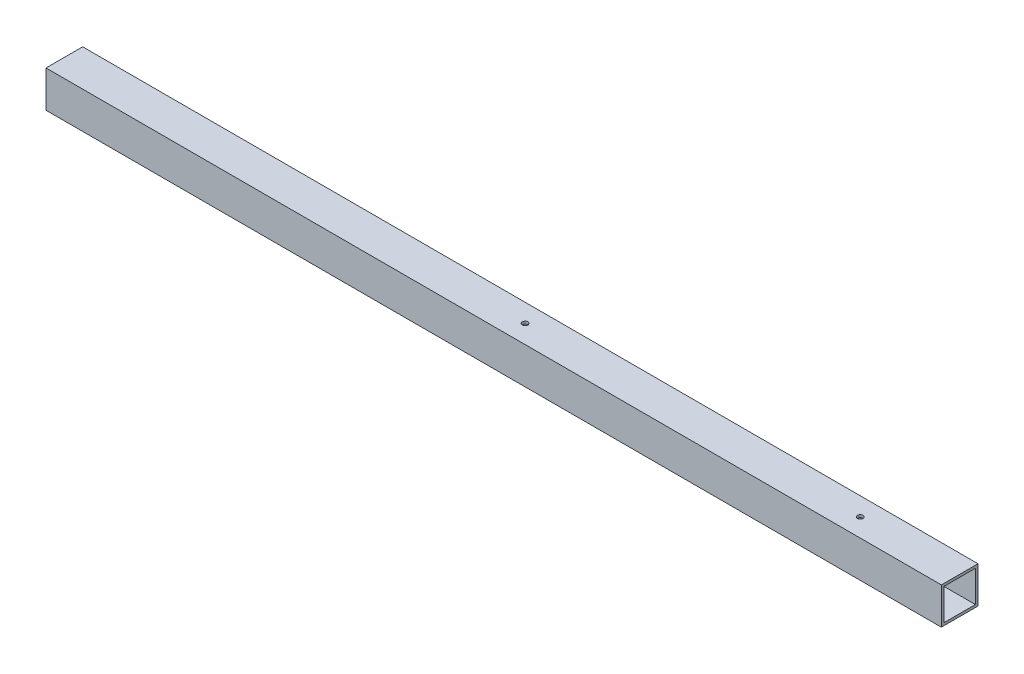
ISO-10303-21;
HEADER;
FILE_DESCRIPTION(('STEP AP214'),'2;1');
FILE_NAME('part.step','',(''),(''),'','','');
FILE_SCHEMA(('AUTOMOTIVE_DESIGN { 1 0 10303 214 1 1 1 1 }'));
ENDSEC;
DATA;
#1=APPLICATION_CONTEXT('core data for automotive mechanical design processes');
#2=APPLICATION_PROTOCOL_DEFINITION('international standard','automotive_design',2000,#1);
#3=PRODUCT_CONTEXT('',#1,'mechanical');
#4=PRODUCT('Part','Part','',(#3));
#5=PRODUCT_RELATED_PRODUCT_CATEGORY('part','',(#4));
#6=PRODUCT_DEFINITION_FORMATION('','',#4);
#7=PRODUCT_DEFINITION_CONTEXT('part definition',#1,'design');
#8=PRODUCT_DEFINITION('design','',#6,#7);
#9=PRODUCT_DEFINITION_SHAPE('','',#8);
#10=(LENGTH_UNIT() NAMED_UNIT(*) SI_UNIT(.MILLI.,.METRE.));
#11=(NAMED_UNIT(*) PLANE_ANGLE_UNIT() SI_UNIT($,.RADIAN.));
#12=(NAMED_UNIT(*) SI_UNIT($,.STERADIAN.) SOLID_ANGLE_UNIT());
#13=UNCERTAINTY_MEASURE_WITH_UNIT(LENGTH_MEASURE(1.E-05),#10,'distance_accuracy_value','');
#14=(GEOMETRIC_REPRESENTATION_CONTEXT(3) GLOBAL_UNCERTAINTY_ASSIGNED_CONTEXT((#13)) GLOBAL_UNIT_ASSIGNED_CONTEXT((#10,
#11,#12)) REPRESENTATION_CONTEXT('',''));
#15=CARTESIAN_POINT('',(0.,0.,0.));
#16=DIRECTION('',(0.,0.,1.));
#17=DIRECTION('',(1.,0.,0.));
#18=AXIS2_PLACEMENT_3D('',#15,#16,#17);
#19=CARTESIAN_POINT('',(0.,0.,44.45));
#20=DIRECTION('',(1.,0.,0.));
#21=DIRECTION('',(0.,0.,-1.));
#22=AXIS2_PLACEMENT_3D('',#19,#20,#21);
#23=PLANE('',#22);
#24=DIRECTION('',(0.,-1.,0.));
#25=VECTOR('',#24,1.);
#26=CARTESIAN_POINT('',(0.,0.,0.));
#27=LINE('',#26,#25);
#28=CARTESIAN_POINT('',(0.,44.45,0.));
#29=VERTEX_POINT('',#28);
#30=CARTESIAN_POINT('',(0.,0.,0.));
#31=VERTEX_POINT('',#30);
#32=EDGE_CURVE('E130',#29,#31,#27,.T.);
#33=ORIENTED_EDGE('',*,*,#32,.T.);
#34=DIRECTION('',(0.,0.,-1.));
#35=VECTOR('',#34,1.);
#36=CARTESIAN_POINT('',(0.,0.,44.45));
#37=LINE('',#36,#35);
#38=CARTESIAN_POINT('',(0.,0.,44.45));
#39=VERTEX_POINT('',#38);
#40=EDGE_CURVE('E11',#39,#31,#37,.T.);
#41=ORIENTED_EDGE('',*,*,#40,.F.);
#42=DIRECTION('',(0.,-1.,0.));
#43=VECTOR('',#42,1.);
#44=CARTESIAN_POINT('',(0.,0.,44.45));
#45=LINE('',#44,#43);
#46=CARTESIAN_POINT('',(0.,44.45,44.45));
#47=VERTEX_POINT('',#46);
#48=EDGE_CURVE('E136',#47,#39,#45,.T.);
#49=ORIENTED_EDGE('',*,*,#48,.F.);
#50=DIRECTION('',(0.,0.,-1.));
#51=VECTOR('',#50,1.);
#52=CARTESIAN_POINT('',(0.,44.45,44.45));
#53=LINE('',#52,#51);
#54=EDGE_CURVE('E146',#47,#29,#53,.T.);
#55=ORIENTED_EDGE('',*,*,#54,.T.);
#56=EDGE_LOOP('',(#33,#41,#49,#55));
#57=FACE_BOUND('',#56,.T.);
#58=DIRECTION('',(0.,-1.,0.));
#59=VECTOR('',#58,1.);
#60=CARTESIAN_POINT('',(0.,0.,3.175));
#61=LINE('',#60,#59);
#62=CARTESIAN_POINT('',(0.,41.275,3.175));
#63=VERTEX_POINT('',#62);
#64=CARTESIAN_POINT('',(0.,3.175,3.175));
#65=VERTEX_POINT('',#64);
#66=EDGE_CURVE('E106',#63,#65,#61,.T.);
#67=ORIENTED_EDGE('',*,*,#66,.F.);
#68=DIRECTION('',(0.,0.,-1.));
#69=VECTOR('',#68,1.);
#70=CARTESIAN_POINT('',(0.,41.275,44.45));
#71=LINE('',#70,#69);
#72=CARTESIAN_POINT('',(0.,41.275,41.275));
#73=VERTEX_POINT('',#72);
#74=EDGE_CURVE('E126',#73,#63,#71,.T.);
#75=ORIENTED_EDGE('',*,*,#74,.F.);
#76=DIRECTION('',(0.,-1.,0.));
#77=VECTOR('',#76,1.);
#78=CARTESIAN_POINT('',(0.,0.,41.275));
#79=LINE('',#78,#77);
#80=CARTESIAN_POINT('',(0.,3.175,41.275));
#81=VERTEX_POINT('',#80);
#82=EDGE_CURVE('E50',#73,#81,#79,.T.);
#83=ORIENTED_EDGE('',*,*,#82,.T.);
#84=DIRECTION('',(0.,0.,-1.));
#85=VECTOR('',#84,1.);
#86=CARTESIAN_POINT('',(0.,3.175,44.45));
#87=LINE('',#86,#85);
#88=EDGE_CURVE('E116',#81,#65,#87,.T.);
#89=ORIENTED_EDGE('',*,*,#88,.T.);
#90=EDGE_LOOP('',(#67,#75,#83,#89));
#91=FACE_BOUND('',#90,.T.);
#92=ADVANCED_FACE('F34',(#57,#91),#23,.F.);
#93=CARTESIAN_POINT('',(1085.85,0.,44.45));
#94=DIRECTION('',(-1.,0.,0.));
#95=DIRECTION('',(0.,0.,1.));
#96=AXIS2_PLACEMENT_3D('',#93,#94,#95);
#97=PLANE('',#96);
#98=DIRECTION('',(0.,1.,0.));
#99=VECTOR('',#98,1.);
#100=CARTESIAN_POINT('',(1085.85,0.,0.));
#101=LINE('',#100,#99);
#102=CARTESIAN_POINT('',(1085.85,0.,0.));
#103=VERTEX_POINT('',#102);
#104=CARTESIAN_POINT('',(1085.85,44.45,0.));
#105=VERTEX_POINT('',#104);
#106=EDGE_CURVE('E151',#103,#105,#101,.T.);
#107=ORIENTED_EDGE('',*,*,#106,.T.);
#108=DIRECTION('',(0.,0.,-1.));
#109=VECTOR('',#108,1.);
#110=CARTESIAN_POINT('',(1085.85,44.45,44.45));
#111=LINE('',#110,#109);
#112=CARTESIAN_POINT('',(1085.85,44.45,44.45));
#113=VERTEX_POINT('',#112);
#114=EDGE_CURVE('E156',#113,#105,#111,.T.);
#115=ORIENTED_EDGE('',*,*,#114,.F.);
#116=DIRECTION('',(0.,1.,0.));
#117=VECTOR('',#116,1.);
#118=CARTESIAN_POINT('',(1085.85,0.,44.45));
#119=LINE('',#118,#117);
#120=CARTESIAN_POINT('',(1085.85,0.,44.45));
#121=VERTEX_POINT('',#120);
#122=EDGE_CURVE('E142',#121,#113,#119,.T.);
#123=ORIENTED_EDGE('',*,*,#122,.F.);
#124=DIRECTION('',(0.,0.,-1.));
#125=VECTOR('',#124,1.);
#126=CARTESIAN_POINT('',(1085.85,0.,44.45));
#127=LINE('',#126,#125);
#128=EDGE_CURVE('E42',#121,#103,#127,.T.);
#129=ORIENTED_EDGE('',*,*,#128,.T.);
#130=EDGE_LOOP('',(#107,#115,#123,#129));
#131=FACE_BOUND('',#130,.T.);
#132=DIRECTION('',(0.,1.,0.));
#133=VECTOR('',#132,1.);
#134=CARTESIAN_POINT('',(1085.85,0.,3.175));
#135=LINE('',#134,#133);
#136=CARTESIAN_POINT('',(1085.85,3.175,3.175));
#137=VERTEX_POINT('',#136);
#138=CARTESIAN_POINT('',(1085.85,41.275,3.175));
#139=VERTEX_POINT('',#138);
#140=EDGE_CURVE('E103',#137,#139,#135,.T.);
#141=ORIENTED_EDGE('',*,*,#140,.F.);
#142=DIRECTION('',(0.,0.,-1.));
#143=VECTOR('',#142,1.);
#144=CARTESIAN_POINT('',(1085.85,3.175,44.45));
#145=LINE('',#144,#143);
#146=CARTESIAN_POINT('',(1085.85,3.175,41.275));
#147=VERTEX_POINT('',#146);
#148=EDGE_CURVE('E112',#147,#137,#145,.T.);
#149=ORIENTED_EDGE('',*,*,#148,.F.);
#150=DIRECTION('',(0.,1.,0.));
#151=VECTOR('',#150,1.);
#152=CARTESIAN_POINT('',(1085.85,0.,41.275));
#153=LINE('',#152,#151);
#154=CARTESIAN_POINT('',(1085.85,41.275,41.275));
#155=VERTEX_POINT('',#154);
#156=EDGE_CURVE('E55',#147,#155,#153,.T.);
#157=ORIENTED_EDGE('',*,*,#156,.T.);
#158=DIRECTION('',(0.,0.,-1.));
#159=VECTOR('',#158,1.);
#160=CARTESIAN_POINT('',(1085.85,41.275,44.45));
#161=LINE('',#160,#159);
#162=EDGE_CURVE('E117',#155,#139,#161,.T.);
#163=ORIENTED_EDGE('',*,*,#162,.T.);
#164=EDGE_LOOP('',(#141,#149,#157,#163));
#165=FACE_BOUND('',#164,.T.);
#166=ADVANCED_FACE('F120',(#131,#165),#97,.F.);
#167=CARTESIAN_POINT('',(0.,0.,44.45));
#168=DIRECTION('',(0.,1.,0.));
#169=DIRECTION('',(0.,0.,1.));
#170=AXIS2_PLACEMENT_3D('',#167,#168,#169);
#171=PLANE('',#170);
#172=CARTESIAN_POINT('',(965.2,0.,22.225));
#173=DIRECTION('',(0.,1.,0.));
#174=DIRECTION('',(0.,0.,1.));
#175=AXIS2_PLACEMENT_3D('',#172,#173,#174);
#176=CIRCLE('',#175,3.3782);
#177=CARTESIAN_POINT('',(965.2,0.,25.6032));
#178=VERTEX_POINT('',#177);
#179=EDGE_CURVE('E251',#178,#178,#176,.T.);
#180=ORIENTED_EDGE('',*,*,#179,.T.);
#181=EDGE_LOOP('',(#180));
#182=FACE_BOUND('',#181,.T.);
#183=CARTESIAN_POINT('',(558.8,0.,22.225));
#184=DIRECTION('',(0.,1.,0.));
#185=DIRECTION('',(0.,0.,1.));
#186=AXIS2_PLACEMENT_3D('',#183,#184,#185);
#187=CIRCLE('',#186,3.3782);
#188=CARTESIAN_POINT('',(558.8,0.,25.6032));
#189=VERTEX_POINT('',#188);
#190=EDGE_CURVE('E162',#189,#189,#187,.T.);
#191=ORIENTED_EDGE('',*,*,#190,.T.);
#192=EDGE_LOOP('',(#191));
#193=FACE_BOUND('',#192,.T.);
#194=DIRECTION('',(1.,0.,0.));
#195=VECTOR('',#194,1.);
#196=CARTESIAN_POINT('',(0.,0.,0.));
#197=LINE('',#196,#195);
#198=EDGE_CURVE('E149',#31,#103,#197,.T.);
#199=ORIENTED_EDGE('',*,*,#198,.T.);
#200=ORIENTED_EDGE('',*,*,#128,.F.);
#201=DIRECTION('',(1.,0.,0.));
#202=VECTOR('',#201,1.);
#203=CARTESIAN_POINT('',(0.,0.,44.45));
#204=LINE('',#203,#202);
#205=EDGE_CURVE('E139',#39,#121,#204,.T.);
#206=ORIENTED_EDGE('',*,*,#205,.F.);
#207=ORIENTED_EDGE('',*,*,#40,.T.);
#208=EDGE_LOOP('',(#199,#200,#206,#207));
#209=FACE_BOUND('',#208,.T.);
#210=ADVANCED_FACE('F187',(#182,#193,#209),#171,.F.);
#211=CARTESIAN_POINT('',(0.,44.45,44.45));
#212=DIRECTION('',(0.,-1.,0.));
#213=DIRECTION('',(0.,0.,-1.));
#214=AXIS2_PLACEMENT_3D('',#211,#212,#213);
#215=PLANE('',#214);
#216=CARTESIAN_POINT('',(965.2,44.45,22.225));
#217=DIRECTION('',(0.,1.,0.));
#218=DIRECTION('',(0.,0.,1.));
#219=AXIS2_PLACEMENT_3D('',#216,#217,#218);
#220=CIRCLE('',#219,3.3782);
#221=CARTESIAN_POINT('',(965.2,44.45,25.6032));
#222=VERTEX_POINT('',#221);
#223=EDGE_CURVE('E250',#222,#222,#220,.T.);
#224=ORIENTED_EDGE('',*,*,#223,.F.);
#225=EDGE_LOOP('',(#224));
#226=FACE_BOUND('',#225,.T.);
#227=CARTESIAN_POINT('',(558.8,44.45,22.225));
#228=DIRECTION('',(0.,1.,0.));
#229=DIRECTION('',(0.,0.,1.));
#230=AXIS2_PLACEMENT_3D('',#227,#228,#229);
#231=CIRCLE('',#230,3.3782);
#232=CARTESIAN_POINT('',(558.8,44.45,25.6032));
#233=VERTEX_POINT('',#232);
#234=EDGE_CURVE('E168',#233,#233,#231,.T.);
#235=ORIENTED_EDGE('',*,*,#234,.F.);
#236=EDGE_LOOP('',(#235));
#237=FACE_BOUND('',#236,.T.);
#238=DIRECTION('',(-1.,0.,0.));
#239=VECTOR('',#238,1.);
#240=CARTESIAN_POINT('',(0.,44.45,0.));
#241=LINE('',#240,#239);
#242=EDGE_CURVE('E140',#105,#29,#241,.T.);
#243=ORIENTED_EDGE('',*,*,#242,.T.);
#244=ORIENTED_EDGE('',*,*,#54,.F.);
#245=DIRECTION('',(-1.,0.,0.));
#246=VECTOR('',#245,1.);
#247=CARTESIAN_POINT('',(0.,44.45,44.45));
#248=LINE('',#247,#246);
#249=EDGE_CURVE('E144',#113,#47,#248,.T.);
#250=ORIENTED_EDGE('',*,*,#249,.F.);
#251=ORIENTED_EDGE('',*,*,#114,.T.);
#252=EDGE_LOOP('',(#243,#244,#250,#251));
#253=FACE_BOUND('',#252,.T.);
#254=ADVANCED_FACE('F206',(#226,#237,#253),#215,.F.);
#255=CARTESIAN_POINT('',(0.,0.,44.45));
#256=DIRECTION('',(0.,0.,-1.));
#257=DIRECTION('',(-1.,0.,0.));
#258=AXIS2_PLACEMENT_3D('',#255,#256,#257);
#259=PLANE('',#258);
#260=ORIENTED_EDGE('',*,*,#48,.T.);
#261=ORIENTED_EDGE('',*,*,#205,.T.);
#262=ORIENTED_EDGE('',*,*,#122,.T.);
#263=ORIENTED_EDGE('',*,*,#249,.T.);
#264=EDGE_LOOP('',(#260,#261,#262,#263));
#265=FACE_BOUND('',#264,.T.);
#266=ADVANCED_FACE('F202',(#265),#259,.F.);
#267=CARTESIAN_POINT('',(0.,0.,0.));
#268=DIRECTION('',(0.,0.,-1.));
#269=DIRECTION('',(-1.,0.,0.));
#270=AXIS2_PLACEMENT_3D('',#267,#268,#269);
#271=PLANE('',#270);
#272=ORIENTED_EDGE('',*,*,#32,.F.);
#273=ORIENTED_EDGE('',*,*,#242,.F.);
#274=ORIENTED_EDGE('',*,*,#106,.F.);
#275=ORIENTED_EDGE('',*,*,#198,.F.);
#276=EDGE_LOOP('',(#272,#273,#274,#275));
#277=FACE_BOUND('',#276,.T.);
#278=ADVANCED_FACE('F196',(#277),#271,.T.);
#279=CARTESIAN_POINT('',(0.,3.175,44.45));
#280=DIRECTION('',(0.,1.,0.));
#281=DIRECTION('',(0.,0.,1.));
#282=AXIS2_PLACEMENT_3D('',#279,#280,#281);
#283=PLANE('',#282);
#284=CARTESIAN_POINT('',(965.2,3.175,22.225));
#285=DIRECTION('',(0.,1.,0.));
#286=DIRECTION('',(0.,0.,1.));
#287=AXIS2_PLACEMENT_3D('',#284,#285,#286);
#288=CIRCLE('',#287,3.3782);
#289=CARTESIAN_POINT('',(965.2,3.175,25.6032));
#290=VERTEX_POINT('',#289);
#291=EDGE_CURVE('E173',#290,#290,#288,.T.);
#292=ORIENTED_EDGE('',*,*,#291,.F.);
#293=EDGE_LOOP('',(#292));
#294=FACE_BOUND('',#293,.T.);
#295=CARTESIAN_POINT('',(558.8,3.175,22.225));
#296=DIRECTION('',(0.,1.,0.));
#297=DIRECTION('',(0.,0.,1.));
#298=AXIS2_PLACEMENT_3D('',#295,#296,#297);
#299=CIRCLE('',#298,3.3782);
#300=CARTESIAN_POINT('',(558.8,3.175,25.6032));
#301=VERTEX_POINT('',#300);
#302=EDGE_CURVE('E160',#301,#301,#299,.T.);
#303=ORIENTED_EDGE('',*,*,#302,.F.);
#304=EDGE_LOOP('',(#303));
#305=FACE_BOUND('',#304,.T.);
#306=DIRECTION('',(1.,0.,0.));
#307=VECTOR('',#306,1.);
#308=CARTESIAN_POINT('',(0.,3.175,3.175));
#309=LINE('',#308,#307);
#310=EDGE_CURVE('E99',#65,#137,#309,.T.);
#311=ORIENTED_EDGE('',*,*,#310,.F.);
#312=ORIENTED_EDGE('',*,*,#88,.F.);
#313=DIRECTION('',(1.,0.,0.));
#314=VECTOR('',#313,1.);
#315=CARTESIAN_POINT('',(0.,3.175,41.275));
#316=LINE('',#315,#314);
#317=EDGE_CURVE('E114',#81,#147,#316,.T.);
#318=ORIENTED_EDGE('',*,*,#317,.T.);
#319=ORIENTED_EDGE('',*,*,#148,.T.);
#320=EDGE_LOOP('',(#311,#312,#318,#319));
#321=FACE_BOUND('',#320,.T.);
#322=ADVANCED_FACE('F113',(#294,#305,#321),#283,.T.);
#323=CARTESIAN_POINT('',(0.,41.275,44.45));
#324=DIRECTION('',(0.,-1.,0.));
#325=DIRECTION('',(0.,0.,-1.));
#326=AXIS2_PLACEMENT_3D('',#323,#324,#325);
#327=PLANE('',#326);
#328=CARTESIAN_POINT('',(965.2,41.275,22.225));
#329=DIRECTION('',(0.,-1.,0.));
#330=DIRECTION('',(0.,0.,-1.));
#331=AXIS2_PLACEMENT_3D('',#328,#329,#330);
#332=CIRCLE('',#331,3.3782);
#333=CARTESIAN_POINT('',(965.2,41.275,18.8468));
#334=VERTEX_POINT('',#333);
#335=EDGE_CURVE('E37',#334,#334,#332,.T.);
#336=ORIENTED_EDGE('',*,*,#335,.F.);
#337=EDGE_LOOP('',(#336));
#338=FACE_BOUND('',#337,.T.);
#339=CARTESIAN_POINT('',(558.8,41.275,22.225));
#340=DIRECTION('',(0.,-1.,0.));
#341=DIRECTION('',(0.,0.,-1.));
#342=AXIS2_PLACEMENT_3D('',#339,#340,#341);
#343=CIRCLE('',#342,3.3782);
#344=CARTESIAN_POINT('',(558.8,41.275,18.8468));
#345=VERTEX_POINT('',#344);
#346=EDGE_CURVE('E135',#345,#345,#343,.T.);
#347=ORIENTED_EDGE('',*,*,#346,.F.);
#348=EDGE_LOOP('',(#347));
#349=FACE_BOUND('',#348,.T.);
#350=DIRECTION('',(-1.,0.,0.));
#351=VECTOR('',#350,1.);
#352=CARTESIAN_POINT('',(0.,41.275,3.175));
#353=LINE('',#352,#351);
#354=EDGE_CURVE('E121',#139,#63,#353,.T.);
#355=ORIENTED_EDGE('',*,*,#354,.F.);
#356=ORIENTED_EDGE('',*,*,#162,.F.);
#357=DIRECTION('',(-1.,0.,0.));
#358=VECTOR('',#357,1.);
#359=CARTESIAN_POINT('',(0.,41.275,41.275));
#360=LINE('',#359,#358);
#361=EDGE_CURVE('E128',#155,#73,#360,.T.);
#362=ORIENTED_EDGE('',*,*,#361,.T.);
#363=ORIENTED_EDGE('',*,*,#74,.T.);
#364=EDGE_LOOP('',(#355,#356,#362,#363));
#365=FACE_BOUND('',#364,.T.);
#366=ADVANCED_FACE('F180',(#338,#349,#365),#327,.T.);
#367=CARTESIAN_POINT('',(0.,0.,41.275));
#368=DIRECTION('',(0.,0.,-1.));
#369=DIRECTION('',(-1.,0.,0.));
#370=AXIS2_PLACEMENT_3D('',#367,#368,#369);
#371=PLANE('',#370);
#372=ORIENTED_EDGE('',*,*,#82,.F.);
#373=ORIENTED_EDGE('',*,*,#361,.F.);
#374=ORIENTED_EDGE('',*,*,#156,.F.);
#375=ORIENTED_EDGE('',*,*,#317,.F.);
#376=EDGE_LOOP('',(#372,#373,#374,#375));
#377=FACE_BOUND('',#376,.T.);
#378=ADVANCED_FACE('F224',(#377),#371,.T.);
#379=CARTESIAN_POINT('',(0.,0.,3.175));
#380=DIRECTION('',(0.,0.,-1.));
#381=DIRECTION('',(-1.,0.,0.));
#382=AXIS2_PLACEMENT_3D('',#379,#380,#381);
#383=PLANE('',#382);
#384=ORIENTED_EDGE('',*,*,#66,.T.);
#385=ORIENTED_EDGE('',*,*,#310,.T.);
#386=ORIENTED_EDGE('',*,*,#140,.T.);
#387=ORIENTED_EDGE('',*,*,#354,.T.);
#388=EDGE_LOOP('',(#384,#385,#386,#387));
#389=FACE_BOUND('',#388,.T.);
#390=ADVANCED_FACE('F101',(#389),#383,.F.);
#391=CARTESIAN_POINT('',(558.8,44.45,22.225));
#392=DIRECTION('',(0.,1.,0.));
#393=DIRECTION('',(0.,0.,1.));
#394=AXIS2_PLACEMENT_3D('',#391,#392,#393);
#395=CYLINDRICAL_SURFACE('',#394,3.3782);
#396=ORIENTED_EDGE('',*,*,#302,.T.);
#397=EDGE_LOOP('',(#396));
#398=FACE_BOUND('',#397,.T.);
#399=ORIENTED_EDGE('',*,*,#190,.F.);
#400=EDGE_LOOP('',(#399));
#401=FACE_BOUND('',#400,.T.);
#402=ADVANCED_FACE('F223',(#398,#401),#395,.F.);
#403=ORIENTED_EDGE('',*,*,#346,.T.);
#404=EDGE_LOOP('',(#403));
#405=FACE_BOUND('',#404,.T.);
#406=ORIENTED_EDGE('',*,*,#234,.T.);
#407=EDGE_LOOP('',(#406));
#408=FACE_BOUND('',#407,.T.);
#409=ADVANCED_FACE('F235',(#405,#408),#395,.F.);
#410=CARTESIAN_POINT('',(965.2,44.45,22.225));
#411=DIRECTION('',(0.,1.,0.));
#412=DIRECTION('',(0.,0.,1.));
#413=AXIS2_PLACEMENT_3D('',#410,#411,#412);
#414=CYLINDRICAL_SURFACE('',#413,3.3782);
#415=ORIENTED_EDGE('',*,*,#335,.T.);
#416=EDGE_LOOP('',(#415));
#417=FACE_BOUND('',#416,.T.);
#418=ORIENTED_EDGE('',*,*,#223,.T.);
#419=EDGE_LOOP('',(#418));
#420=FACE_BOUND('',#419,.T.);
#421=ADVANCED_FACE('F236',(#417,#420),#414,.F.);
#422=ORIENTED_EDGE('',*,*,#291,.T.);
#423=EDGE_LOOP('',(#422));
#424=FACE_BOUND('',#423,.T.);
#425=ORIENTED_EDGE('',*,*,#179,.F.);
#426=EDGE_LOOP('',(#425));
#427=FACE_BOUND('',#426,.T.);
#428=ADVANCED_FACE('F238',(#424,#427),#414,.F.);
#429=CLOSED_SHELL('',(#92,#166,#210,#254,#266,#278,#322,#366,#378,#390,#402,#409,#421,#428));
#430=MANIFOLD_SOLID_BREP('B2',#429);
#431=ADVANCED_BREP_SHAPE_REPRESENTATION('',(#18,#430),#14);
#432=SHAPE_DEFINITION_REPRESENTATION(#9,#431);
ENDSEC;
END-ISO-10303-21;
